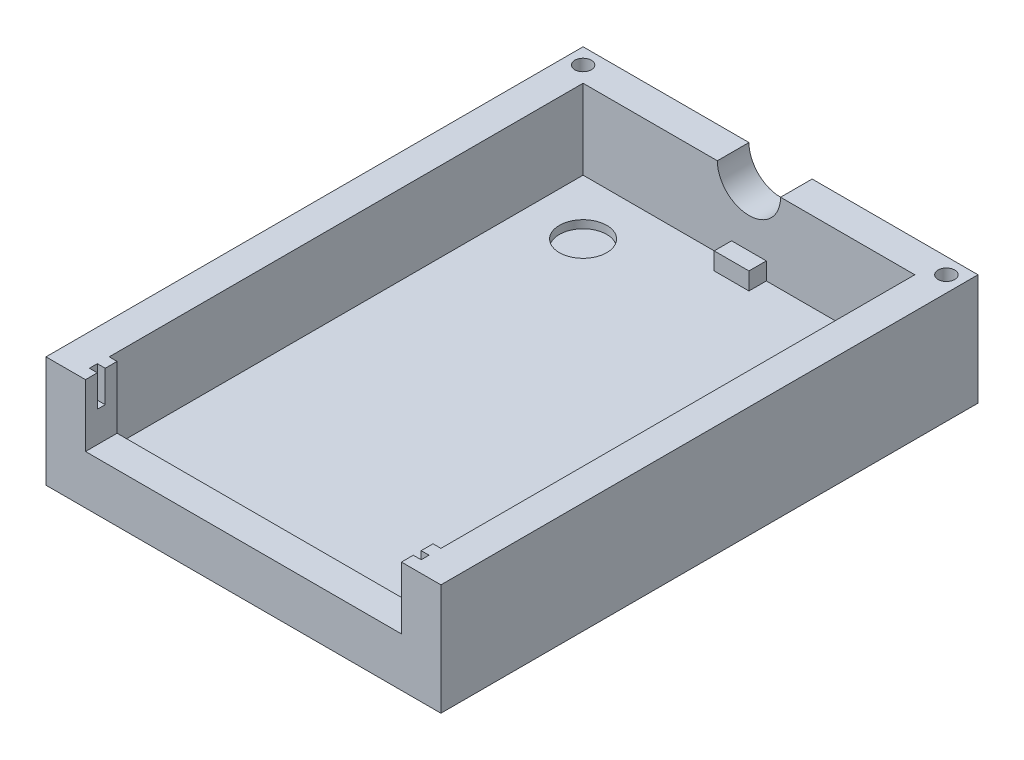
ISO-10303-21;
HEADER;
FILE_DESCRIPTION(('STEP AP214'),'2;1');
FILE_NAME('part.step','',(''),(''),'','','');
FILE_SCHEMA(('AUTOMOTIVE_DESIGN { 1 0 10303 214 1 1 1 1 }'));
ENDSEC;
DATA;
#1=APPLICATION_CONTEXT('core data for automotive mechanical design processes');
#2=APPLICATION_PROTOCOL_DEFINITION('international standard','automotive_design',2000,#1);
#3=PRODUCT_CONTEXT('',#1,'mechanical');
#4=PRODUCT('Part','Part','',(#3));
#5=PRODUCT_RELATED_PRODUCT_CATEGORY('part','',(#4));
#6=PRODUCT_DEFINITION_FORMATION('','',#4);
#7=PRODUCT_DEFINITION_CONTEXT('part definition',#1,'design');
#8=PRODUCT_DEFINITION('design','',#6,#7);
#9=PRODUCT_DEFINITION_SHAPE('','',#8);
#10=(LENGTH_UNIT() NAMED_UNIT(*) SI_UNIT(.MILLI.,.METRE.));
#11=(NAMED_UNIT(*) PLANE_ANGLE_UNIT() SI_UNIT($,.RADIAN.));
#12=(NAMED_UNIT(*) SI_UNIT($,.STERADIAN.) SOLID_ANGLE_UNIT());
#13=UNCERTAINTY_MEASURE_WITH_UNIT(LENGTH_MEASURE(1.E-05),#10,'distance_accuracy_value','');
#14=(GEOMETRIC_REPRESENTATION_CONTEXT(3) GLOBAL_UNCERTAINTY_ASSIGNED_CONTEXT((#13)) GLOBAL_UNIT_ASSIGNED_CONTEXT((#10,
#11,#12)) REPRESENTATION_CONTEXT('',''));
#15=CARTESIAN_POINT('',(0.,0.,0.));
#16=DIRECTION('',(0.,0.,1.));
#17=DIRECTION('',(1.,0.,0.));
#18=AXIS2_PLACEMENT_3D('',#15,#16,#17);
#19=CARTESIAN_POINT('',(0.,7.04,0.));
#20=DIRECTION('',(0.,1.,0.));
#21=DIRECTION('',(0.,0.,1.));
#22=AXIS2_PLACEMENT_3D('',#19,#20,#21);
#23=PLANE('',#22);
#24=CARTESIAN_POINT('',(11.5000000000001,7.04,-15.9999999999998));
#25=DIRECTION('',(0.,1.,0.));
#26=DIRECTION('',(0.,0.,1.));
#27=AXIS2_PLACEMENT_3D('',#24,#25,#26);
#28=CIRCLE('',#27,0.525);
#29=CARTESIAN_POINT('',(11.5000000000001,7.04,-15.4749999999998));
#30=VERTEX_POINT('',#29);
#31=EDGE_CURVE('E442',#30,#30,#28,.T.);
#32=ORIENTED_EDGE('',*,*,#31,.F.);
#33=EDGE_LOOP('',(#32));
#34=FACE_BOUND('',#33,.T.);
#35=DIRECTION('',(0.,0.,-1.));
#36=VECTOR('',#35,1.);
#37=CARTESIAN_POINT('',(2.,7.04,-15.));
#38=LINE('',#37,#36);
#39=CARTESIAN_POINT('',(2.,7.04,-15.));
#40=VERTEX_POINT('',#39);
#41=CARTESIAN_POINT('',(2.,7.04,-17.));
#42=VERTEX_POINT('',#41);
#43=EDGE_CURVE('E217',#40,#42,#38,.T.);
#44=ORIENTED_EDGE('',*,*,#43,.F.);
#45=DIRECTION('',(-1.,0.,0.));
#46=VECTOR('',#45,1.);
#47=CARTESIAN_POINT('',(10.5,7.04,-15.));
#48=LINE('',#47,#46);
#49=CARTESIAN_POINT('',(10.5,7.04,-15.));
#50=VERTEX_POINT('',#49);
#51=EDGE_CURVE('E226',#50,#40,#48,.T.);
#52=ORIENTED_EDGE('',*,*,#51,.F.);
#53=DIRECTION('',(0.,0.,-1.));
#54=VECTOR('',#53,1.);
#55=CARTESIAN_POINT('',(10.5,7.04,15.));
#56=LINE('',#55,#54);
#57=CARTESIAN_POINT('',(10.5,7.04,15.));
#58=VERTEX_POINT('',#57);
#59=EDGE_CURVE('E242',#58,#50,#56,.T.);
#60=ORIENTED_EDGE('',*,*,#59,.F.);
#61=DIRECTION('',(1.,0.,0.));
#62=VECTOR('',#61,1.);
#63=CARTESIAN_POINT('',(-10.5,7.04,15.));
#64=LINE('',#63,#62);
#65=CARTESIAN_POINT('',(9.99999999999999,7.04,15.));
#66=VERTEX_POINT('',#65);
#67=EDGE_CURVE('E346',#66,#58,#64,.T.);
#68=ORIENTED_EDGE('',*,*,#67,.F.);
#69=DIRECTION('',(0.,0.,-1.));
#70=VECTOR('',#69,1.);
#71=CARTESIAN_POINT('',(10.,7.04,17.));
#72=LINE('',#71,#70);
#73=CARTESIAN_POINT('',(10.,7.04,15.75));
#74=VERTEX_POINT('',#73);
#75=EDGE_CURVE('E326',#74,#66,#72,.T.);
#76=ORIENTED_EDGE('',*,*,#75,.F.);
#77=DIRECTION('',(-1.,0.,0.));
#78=VECTOR('',#77,1.);
#79=CARTESIAN_POINT('',(9.5,7.04,15.75));
#80=LINE('',#79,#78);
#81=CARTESIAN_POINT('',(10.5,7.04,15.75));
#82=VERTEX_POINT('',#81);
#83=EDGE_CURVE('E403',#82,#74,#80,.T.);
#84=ORIENTED_EDGE('',*,*,#83,.F.);
#85=DIRECTION('',(0.,0.,-1.));
#86=VECTOR('',#85,1.);
#87=CARTESIAN_POINT('',(10.5,7.04,15.75));
#88=LINE('',#87,#86);
#89=CARTESIAN_POINT('',(10.5,7.04,16.25));
#90=VERTEX_POINT('',#89);
#91=EDGE_CURVE('E399',#90,#82,#88,.T.);
#92=ORIENTED_EDGE('',*,*,#91,.F.);
#93=DIRECTION('',(1.,0.,0.));
#94=VECTOR('',#93,1.);
#95=CARTESIAN_POINT('',(9.5,7.04,16.25));
#96=LINE('',#95,#94);
#97=CARTESIAN_POINT('',(10.,7.04,16.25));
#98=VERTEX_POINT('',#97);
#99=EDGE_CURVE('E393',#98,#90,#96,.T.);
#100=ORIENTED_EDGE('',*,*,#99,.F.);
#101=CARTESIAN_POINT('',(10.,7.04,17.));
#102=VERTEX_POINT('',#101);
#103=EDGE_CURVE('E329',#102,#98,#72,.T.);
#104=ORIENTED_EDGE('',*,*,#103,.F.);
#105=DIRECTION('',(1.,0.,0.));
#106=VECTOR('',#105,1.);
#107=CARTESIAN_POINT('',(-12.5,7.04,17.));
#108=LINE('',#107,#106);
#109=CARTESIAN_POINT('',(12.5,7.04,17.));
#110=VERTEX_POINT('',#109);
#111=EDGE_CURVE('E271',#102,#110,#108,.T.);
#112=ORIENTED_EDGE('',*,*,#111,.T.);
#113=DIRECTION('',(0.,0.,-1.));
#114=VECTOR('',#113,1.);
#115=CARTESIAN_POINT('',(12.5,7.04,17.));
#116=LINE('',#115,#114);
#117=CARTESIAN_POINT('',(12.5,7.04,-17.));
#118=VERTEX_POINT('',#117);
#119=EDGE_CURVE('E275',#110,#118,#116,.T.);
#120=ORIENTED_EDGE('',*,*,#119,.T.);
#121=DIRECTION('',(-1.,0.,0.));
#122=VECTOR('',#121,1.);
#123=CARTESIAN_POINT('',(12.5,7.04,-17.));
#124=LINE('',#123,#122);
#125=EDGE_CURVE('E229',#118,#42,#124,.T.);
#126=ORIENTED_EDGE('',*,*,#125,.T.);
#127=EDGE_LOOP('',(#44,#52,#60,#68,#76,#84,#92,#100,#104,#112,#120,#126));
#128=FACE_BOUND('',#127,.T.);
#129=ADVANCED_FACE('F45',(#34,#128),#23,.T.);
#130=CARTESIAN_POINT('',(-12.5,0.,-17.));
#131=DIRECTION('',(-1.,0.,0.));
#132=DIRECTION('',(0.,0.,1.));
#133=AXIS2_PLACEMENT_3D('',#130,#131,#132);
#134=PLANE('',#133);
#135=DIRECTION('',(0.,0.,1.));
#136=VECTOR('',#135,1.);
#137=CARTESIAN_POINT('',(-12.5,7.04,-17.));
#138=LINE('',#137,#136);
#139=CARTESIAN_POINT('',(-12.5,7.04,-17.));
#140=VERTEX_POINT('',#139);
#141=CARTESIAN_POINT('',(-12.5,7.04,17.));
#142=VERTEX_POINT('',#141);
#143=EDGE_CURVE('E248',#140,#142,#138,.T.);
#144=ORIENTED_EDGE('',*,*,#143,.F.);
#145=DIRECTION('',(0.,1.,0.));
#146=VECTOR('',#145,1.);
#147=CARTESIAN_POINT('',(-12.5,0.,-17.));
#148=LINE('',#147,#146);
#149=CARTESIAN_POINT('',(-12.5,0.,-17.));
#150=VERTEX_POINT('',#149);
#151=EDGE_CURVE('E279',#150,#140,#148,.T.);
#152=ORIENTED_EDGE('',*,*,#151,.F.);
#153=DIRECTION('',(0.,0.,1.));
#154=VECTOR('',#153,1.);
#155=CARTESIAN_POINT('',(-12.5,0.,-17.));
#156=LINE('',#155,#154);
#157=CARTESIAN_POINT('',(-12.5,0.,17.));
#158=VERTEX_POINT('',#157);
#159=EDGE_CURVE('E257',#150,#158,#156,.T.);
#160=ORIENTED_EDGE('',*,*,#159,.T.);
#161=DIRECTION('',(0.,1.,0.));
#162=VECTOR('',#161,1.);
#163=CARTESIAN_POINT('',(-12.5,0.,17.));
#164=LINE('',#163,#162);
#165=EDGE_CURVE('E268',#158,#142,#164,.T.);
#166=ORIENTED_EDGE('',*,*,#165,.T.);
#167=EDGE_LOOP('',(#144,#152,#160,#166));
#168=FACE_BOUND('',#167,.T.);
#169=ADVANCED_FACE('F47',(#168),#134,.T.);
#170=CARTESIAN_POINT('',(12.5,0.,-17.));
#171=DIRECTION('',(0.,0.,-1.));
#172=DIRECTION('',(-1.,0.,0.));
#173=AXIS2_PLACEMENT_3D('',#170,#171,#172);
#174=PLANE('',#173);
#175=CARTESIAN_POINT('',(0.,7.04,-17.));
#176=DIRECTION('',(0.,0.,-1.));
#177=DIRECTION('',(-1.,0.,0.));
#178=AXIS2_PLACEMENT_3D('',#175,#176,#177);
#179=CIRCLE('',#178,2.);
#180=CARTESIAN_POINT('',(-2.,7.04,-17.));
#181=VERTEX_POINT('',#180);
#182=EDGE_CURVE('E424',#42,#181,#179,.T.);
#183=ORIENTED_EDGE('',*,*,#182,.F.);
#184=ORIENTED_EDGE('',*,*,#125,.F.);
#185=DIRECTION('',(0.,1.,0.));
#186=VECTOR('',#185,1.);
#187=CARTESIAN_POINT('',(12.5,0.,-17.));
#188=LINE('',#187,#186);
#189=CARTESIAN_POINT('',(12.5,0.,-17.));
#190=VERTEX_POINT('',#189);
#191=EDGE_CURVE('E283',#190,#118,#188,.T.);
#192=ORIENTED_EDGE('',*,*,#191,.F.);
#193=DIRECTION('',(-1.,0.,0.));
#194=VECTOR('',#193,1.);
#195=CARTESIAN_POINT('',(12.5,0.,-17.));
#196=LINE('',#195,#194);
#197=EDGE_CURVE('E266',#190,#150,#196,.T.);
#198=ORIENTED_EDGE('',*,*,#197,.T.);
#199=ORIENTED_EDGE('',*,*,#151,.T.);
#200=EDGE_CURVE('E277',#181,#140,#124,.T.);
#201=ORIENTED_EDGE('',*,*,#200,.F.);
#202=EDGE_LOOP('',(#183,#184,#192,#198,#199,#201));
#203=FACE_BOUND('',#202,.T.);
#204=ADVANCED_FACE('F481',(#203),#174,.T.);
#205=CARTESIAN_POINT('',(12.5,0.,17.));
#206=DIRECTION('',(1.,0.,0.));
#207=DIRECTION('',(0.,0.,-1.));
#208=AXIS2_PLACEMENT_3D('',#205,#206,#207);
#209=PLANE('',#208);
#210=ORIENTED_EDGE('',*,*,#119,.F.);
#211=DIRECTION('',(0.,1.,0.));
#212=VECTOR('',#211,1.);
#213=CARTESIAN_POINT('',(12.5,0.,17.));
#214=LINE('',#213,#212);
#215=CARTESIAN_POINT('',(12.5,0.,17.));
#216=VERTEX_POINT('',#215);
#217=EDGE_CURVE('E285',#216,#110,#214,.T.);
#218=ORIENTED_EDGE('',*,*,#217,.F.);
#219=DIRECTION('',(0.,0.,-1.));
#220=VECTOR('',#219,1.);
#221=CARTESIAN_POINT('',(12.5,0.,17.));
#222=LINE('',#221,#220);
#223=EDGE_CURVE('E263',#216,#190,#222,.T.);
#224=ORIENTED_EDGE('',*,*,#223,.T.);
#225=ORIENTED_EDGE('',*,*,#191,.T.);
#226=EDGE_LOOP('',(#210,#218,#224,#225));
#227=FACE_BOUND('',#226,.T.);
#228=ADVANCED_FACE('F603',(#227),#209,.T.);
#229=CARTESIAN_POINT('',(-12.5,0.,17.));
#230=DIRECTION('',(0.,0.,1.));
#231=DIRECTION('',(1.,0.,0.));
#232=AXIS2_PLACEMENT_3D('',#229,#230,#231);
#233=PLANE('',#232);
#234=DIRECTION('',(0.,1.,0.));
#235=VECTOR('',#234,1.);
#236=CARTESIAN_POINT('',(-10.,3.1,17.));
#237=LINE('',#236,#235);
#238=CARTESIAN_POINT('',(-10.,3.1,17.));
#239=VERTEX_POINT('',#238);
#240=CARTESIAN_POINT('',(-10.,7.04,17.));
#241=VERTEX_POINT('',#240);
#242=EDGE_CURVE('E360',#239,#241,#237,.T.);
#243=ORIENTED_EDGE('',*,*,#242,.T.);
#244=EDGE_CURVE('E272',#142,#241,#108,.T.);
#245=ORIENTED_EDGE('',*,*,#244,.F.);
#246=ORIENTED_EDGE('',*,*,#165,.F.);
#247=DIRECTION('',(1.,0.,0.));
#248=VECTOR('',#247,1.);
#249=CARTESIAN_POINT('',(-12.5,0.,17.));
#250=LINE('',#249,#248);
#251=EDGE_CURVE('E260',#158,#216,#250,.T.);
#252=ORIENTED_EDGE('',*,*,#251,.T.);
#253=ORIENTED_EDGE('',*,*,#217,.T.);
#254=ORIENTED_EDGE('',*,*,#111,.F.);
#255=DIRECTION('',(0.,-1.,0.));
#256=VECTOR('',#255,1.);
#257=CARTESIAN_POINT('',(10.,7.04,17.));
#258=LINE('',#257,#256);
#259=CARTESIAN_POINT('',(10.,3.1,17.));
#260=VERTEX_POINT('',#259);
#261=EDGE_CURVE('E369',#102,#260,#258,.T.);
#262=ORIENTED_EDGE('',*,*,#261,.T.);
#263=DIRECTION('',(-1.,0.,0.));
#264=VECTOR('',#263,1.);
#265=CARTESIAN_POINT('',(10.,3.1,17.));
#266=LINE('',#265,#264);
#267=EDGE_CURVE('E331',#260,#239,#266,.T.);
#268=ORIENTED_EDGE('',*,*,#267,.T.);
#269=EDGE_LOOP('',(#243,#245,#246,#252,#253,#254,#262,#268));
#270=FACE_BOUND('',#269,.T.);
#271=ADVANCED_FACE('F472',(#270),#233,.T.);
#272=CARTESIAN_POINT('',(0.,0.,0.));
#273=DIRECTION('',(0.,1.,0.));
#274=DIRECTION('',(0.,0.,1.));
#275=AXIS2_PLACEMENT_3D('',#272,#273,#274);
#276=PLANE('',#275);
#277=ORIENTED_EDGE('',*,*,#159,.F.);
#278=ORIENTED_EDGE('',*,*,#197,.F.);
#279=ORIENTED_EDGE('',*,*,#223,.F.);
#280=ORIENTED_EDGE('',*,*,#251,.F.);
#281=EDGE_LOOP('',(#277,#278,#279,#280));
#282=FACE_BOUND('',#281,.T.);
#283=ADVANCED_FACE('F462',(#282),#276,.F.);
#284=CARTESIAN_POINT('',(-11.4999999999999,7.04,-16.));
#285=DIRECTION('',(0.,1.,0.));
#286=DIRECTION('',(0.,0.,1.));
#287=AXIS2_PLACEMENT_3D('',#284,#285,#286);
#288=CIRCLE('',#287,0.525);
#289=CARTESIAN_POINT('',(-11.4999999999999,7.04,-15.475));
#290=VERTEX_POINT('',#289);
#291=EDGE_CURVE('E445',#290,#290,#288,.T.);
#292=ORIENTED_EDGE('',*,*,#291,.F.);
#293=EDGE_LOOP('',(#292));
#294=FACE_BOUND('',#293,.T.);
#295=DIRECTION('',(0.,0.,-1.));
#296=VECTOR('',#295,1.);
#297=CARTESIAN_POINT('',(-2.,7.04,-15.));
#298=LINE('',#297,#296);
#299=CARTESIAN_POINT('',(-2.,7.04,-15.));
#300=VERTEX_POINT('',#299);
#301=EDGE_CURVE('E60',#181,#300,#298,.F.);
#302=ORIENTED_EDGE('',*,*,#301,.F.);
#303=ORIENTED_EDGE('',*,*,#200,.T.);
#304=ORIENTED_EDGE('',*,*,#143,.T.);
#305=ORIENTED_EDGE('',*,*,#244,.T.);
#306=DIRECTION('',(0.,0.,-1.));
#307=VECTOR('',#306,1.);
#308=CARTESIAN_POINT('',(-10.,7.04,17.));
#309=LINE('',#308,#307);
#310=CARTESIAN_POINT('',(-10.,7.04,16.25));
#311=VERTEX_POINT('',#310);
#312=EDGE_CURVE('E317',#241,#311,#309,.T.);
#313=ORIENTED_EDGE('',*,*,#312,.T.);
#314=DIRECTION('',(1.,0.,0.));
#315=VECTOR('',#314,1.);
#316=CARTESIAN_POINT('',(-10.5,7.04,16.25));
#317=LINE('',#316,#315);
#318=CARTESIAN_POINT('',(-10.5,7.04,16.25));
#319=VERTEX_POINT('',#318);
#320=EDGE_CURVE('E324',#319,#311,#317,.T.);
#321=ORIENTED_EDGE('',*,*,#320,.F.);
#322=DIRECTION('',(0.,0.,1.));
#323=VECTOR('',#322,1.);
#324=CARTESIAN_POINT('',(-10.5,7.04,15.75));
#325=LINE('',#324,#323);
#326=CARTESIAN_POINT('',(-10.5,7.04,15.75));
#327=VERTEX_POINT('',#326);
#328=EDGE_CURVE('E415',#327,#319,#325,.T.);
#329=ORIENTED_EDGE('',*,*,#328,.F.);
#330=DIRECTION('',(-1.,0.,0.));
#331=VECTOR('',#330,1.);
#332=CARTESIAN_POINT('',(-10.5,7.04,15.75));
#333=LINE('',#332,#331);
#334=CARTESIAN_POINT('',(-10.,7.04,15.75));
#335=VERTEX_POINT('',#334);
#336=EDGE_CURVE('E402',#335,#327,#333,.T.);
#337=ORIENTED_EDGE('',*,*,#336,.F.);
#338=CARTESIAN_POINT('',(-10.,7.04,15.));
#339=VERTEX_POINT('',#338);
#340=EDGE_CURVE('E327',#335,#339,#309,.T.);
#341=ORIENTED_EDGE('',*,*,#340,.T.);
#342=CARTESIAN_POINT('',(-10.5,7.04,15.));
#343=VERTEX_POINT('',#342);
#344=EDGE_CURVE('E344',#343,#339,#64,.T.);
#345=ORIENTED_EDGE('',*,*,#344,.F.);
#346=DIRECTION('',(0.,0.,1.));
#347=VECTOR('',#346,1.);
#348=CARTESIAN_POINT('',(-10.5,7.04,-15.));
#349=LINE('',#348,#347);
#350=CARTESIAN_POINT('',(-10.5,7.04,-15.));
#351=VERTEX_POINT('',#350);
#352=EDGE_CURVE('E236',#351,#343,#349,.T.);
#353=ORIENTED_EDGE('',*,*,#352,.F.);
#354=EDGE_CURVE('E237',#300,#351,#48,.T.);
#355=ORIENTED_EDGE('',*,*,#354,.F.);
#356=EDGE_LOOP('',(#302,#303,#304,#305,#313,#321,#329,#337,#341,#345,#353,#355));
#357=FACE_BOUND('',#356,.T.);
#358=ADVANCED_FACE('F322',(#294,#357),#23,.T.);
#359=CARTESIAN_POINT('',(-10.5,2.,15.));
#360=DIRECTION('',(0.,0.,1.));
#361=DIRECTION('',(1.,0.,0.));
#362=AXIS2_PLACEMENT_3D('',#359,#360,#361);
#363=PLANE('',#362);
#364=ORIENTED_EDGE('',*,*,#344,.T.);
#365=DIRECTION('',(0.,1.,0.));
#366=VECTOR('',#365,1.);
#367=CARTESIAN_POINT('',(-10.,3.1,15.));
#368=LINE('',#367,#366);
#369=CARTESIAN_POINT('',(-10.,3.1,15.));
#370=VERTEX_POINT('',#369);
#371=EDGE_CURVE('E364',#370,#339,#368,.T.);
#372=ORIENTED_EDGE('',*,*,#371,.F.);
#373=DIRECTION('',(-1.,0.,0.));
#374=VECTOR('',#373,1.);
#375=CARTESIAN_POINT('',(10.,3.1,15.));
#376=LINE('',#375,#374);
#377=CARTESIAN_POINT('',(10.,3.1,15.));
#378=VERTEX_POINT('',#377);
#379=EDGE_CURVE('E358',#378,#370,#376,.T.);
#380=ORIENTED_EDGE('',*,*,#379,.F.);
#381=DIRECTION('',(0.,-1.,0.));
#382=VECTOR('',#381,1.);
#383=CARTESIAN_POINT('',(10.,7.04,15.));
#384=LINE('',#383,#382);
#385=EDGE_CURVE('E361',#66,#378,#384,.T.);
#386=ORIENTED_EDGE('',*,*,#385,.F.);
#387=ORIENTED_EDGE('',*,*,#67,.T.);
#388=DIRECTION('',(0.,1.,0.));
#389=VECTOR('',#388,1.);
#390=CARTESIAN_POINT('',(10.5,2.,15.));
#391=LINE('',#390,#389);
#392=CARTESIAN_POINT('',(10.5,2.,15.));
#393=VERTEX_POINT('',#392);
#394=EDGE_CURVE('E253',#393,#58,#391,.T.);
#395=ORIENTED_EDGE('',*,*,#394,.F.);
#396=DIRECTION('',(1.,0.,0.));
#397=VECTOR('',#396,1.);
#398=CARTESIAN_POINT('',(-10.5,2.,15.));
#399=LINE('',#398,#397);
#400=CARTESIAN_POINT('',(-10.5,2.,15.));
#401=VERTEX_POINT('',#400);
#402=EDGE_CURVE('E240',#401,#393,#399,.T.);
#403=ORIENTED_EDGE('',*,*,#402,.F.);
#404=DIRECTION('',(0.,1.,0.));
#405=VECTOR('',#404,1.);
#406=CARTESIAN_POINT('',(-10.5,2.,15.));
#407=LINE('',#406,#405);
#408=EDGE_CURVE('E246',#401,#343,#407,.T.);
#409=ORIENTED_EDGE('',*,*,#408,.T.);
#410=EDGE_LOOP('',(#364,#372,#380,#386,#387,#395,#403,#409));
#411=FACE_BOUND('',#410,.T.);
#412=ADVANCED_FACE('F461',(#411),#363,.F.);
#413=CARTESIAN_POINT('',(-10.5,2.,-15.));
#414=DIRECTION('',(-1.,0.,0.));
#415=DIRECTION('',(0.,0.,1.));
#416=AXIS2_PLACEMENT_3D('',#413,#414,#415);
#417=PLANE('',#416);
#418=ORIENTED_EDGE('',*,*,#352,.T.);
#419=ORIENTED_EDGE('',*,*,#408,.F.);
#420=DIRECTION('',(0.,0.,1.));
#421=VECTOR('',#420,1.);
#422=CARTESIAN_POINT('',(-10.5,2.,-15.));
#423=LINE('',#422,#421);
#424=CARTESIAN_POINT('',(-10.5,2.,-15.));
#425=VERTEX_POINT('',#424);
#426=EDGE_CURVE('E256',#425,#401,#423,.T.);
#427=ORIENTED_EDGE('',*,*,#426,.F.);
#428=DIRECTION('',(0.,1.,0.));
#429=VECTOR('',#428,1.);
#430=CARTESIAN_POINT('',(-10.5,2.,-15.));
#431=LINE('',#430,#429);
#432=EDGE_CURVE('E249',#425,#351,#431,.T.);
#433=ORIENTED_EDGE('',*,*,#432,.T.);
#434=EDGE_LOOP('',(#418,#419,#427,#433));
#435=FACE_BOUND('',#434,.T.);
#436=ADVANCED_FACE('F469',(#435),#417,.F.);
#437=CARTESIAN_POINT('',(10.5,2.,-15.));
#438=DIRECTION('',(0.,0.,-1.));
#439=DIRECTION('',(-1.,0.,0.));
#440=AXIS2_PLACEMENT_3D('',#437,#438,#439);
#441=PLANE('',#440);
#442=ORIENTED_EDGE('',*,*,#51,.T.);
#443=CARTESIAN_POINT('',(0.,7.04,-15.));
#444=DIRECTION('',(0.,0.,-1.));
#445=DIRECTION('',(-1.,0.,0.));
#446=AXIS2_PLACEMENT_3D('',#443,#444,#445);
#447=CIRCLE('',#446,2.);
#448=EDGE_CURVE('E11',#40,#300,#447,.T.);
#449=ORIENTED_EDGE('',*,*,#448,.T.);
#450=ORIENTED_EDGE('',*,*,#354,.T.);
#451=ORIENTED_EDGE('',*,*,#432,.F.);
#452=DIRECTION('',(-1.,0.,0.));
#453=VECTOR('',#452,1.);
#454=CARTESIAN_POINT('',(10.5,2.,-15.));
#455=LINE('',#454,#453);
#456=CARTESIAN_POINT('',(-1.1,2.,-15.));
#457=VERTEX_POINT('',#456);
#458=EDGE_CURVE('E339',#457,#425,#455,.T.);
#459=ORIENTED_EDGE('',*,*,#458,.F.);
#460=DIRECTION('',(0.,-1.,0.));
#461=VECTOR('',#460,1.);
#462=CARTESIAN_POINT('',(-1.1,2.,-15.));
#463=LINE('',#462,#461);
#464=CARTESIAN_POINT('',(-1.1,3.1,-15.));
#465=VERTEX_POINT('',#464);
#466=EDGE_CURVE('E374',#465,#457,#463,.T.);
#467=ORIENTED_EDGE('',*,*,#466,.F.);
#468=DIRECTION('',(1.,0.,0.));
#469=VECTOR('',#468,1.);
#470=CARTESIAN_POINT('',(10.5,3.1,-15.));
#471=LINE('',#470,#469);
#472=CARTESIAN_POINT('',(1.1,3.1,-15.));
#473=VERTEX_POINT('',#472);
#474=EDGE_CURVE('E296',#465,#473,#471,.T.);
#475=ORIENTED_EDGE('',*,*,#474,.T.);
#476=DIRECTION('',(0.,-1.,0.));
#477=VECTOR('',#476,1.);
#478=CARTESIAN_POINT('',(1.1,2.,-15.));
#479=LINE('',#478,#477);
#480=CARTESIAN_POINT('',(1.1,2.,-15.));
#481=VERTEX_POINT('',#480);
#482=EDGE_CURVE('E366',#473,#481,#479,.T.);
#483=ORIENTED_EDGE('',*,*,#482,.T.);
#484=CARTESIAN_POINT('',(10.5,2.,-15.));
#485=VERTEX_POINT('',#484);
#486=EDGE_CURVE('E340',#485,#481,#455,.T.);
#487=ORIENTED_EDGE('',*,*,#486,.F.);
#488=DIRECTION('',(0.,1.,0.));
#489=VECTOR('',#488,1.);
#490=CARTESIAN_POINT('',(10.5,2.,-15.));
#491=LINE('',#490,#489);
#492=EDGE_CURVE('E234',#485,#50,#491,.T.);
#493=ORIENTED_EDGE('',*,*,#492,.T.);
#494=EDGE_LOOP('',(#442,#449,#450,#451,#459,#467,#475,#483,#487,#493));
#495=FACE_BOUND('',#494,.T.);
#496=ADVANCED_FACE('F232',(#495),#441,.F.);
#497=CARTESIAN_POINT('',(10.5,2.,15.));
#498=DIRECTION('',(1.,0.,0.));
#499=DIRECTION('',(0.,0.,-1.));
#500=AXIS2_PLACEMENT_3D('',#497,#498,#499);
#501=PLANE('',#500);
#502=ORIENTED_EDGE('',*,*,#59,.T.);
#503=ORIENTED_EDGE('',*,*,#492,.F.);
#504=DIRECTION('',(0.,0.,-1.));
#505=VECTOR('',#504,1.);
#506=CARTESIAN_POINT('',(10.5,2.,15.));
#507=LINE('',#506,#505);
#508=EDGE_CURVE('E336',#393,#485,#507,.T.);
#509=ORIENTED_EDGE('',*,*,#508,.F.);
#510=ORIENTED_EDGE('',*,*,#394,.T.);
#511=EDGE_LOOP('',(#502,#503,#509,#510));
#512=FACE_BOUND('',#511,.T.);
#513=ADVANCED_FACE('F575',(#512),#501,.F.);
#514=CARTESIAN_POINT('',(0.,2.,0.));
#515=DIRECTION('',(0.,1.,0.));
#516=DIRECTION('',(0.,0.,1.));
#517=AXIS2_PLACEMENT_3D('',#514,#515,#516);
#518=PLANE('',#517);
#519=CARTESIAN_POINT('',(-7.,2.,-11.5));
#520=DIRECTION('',(0.,1.,0.));
#521=DIRECTION('',(0.,0.,1.));
#522=AXIS2_PLACEMENT_3D('',#519,#520,#521);
#523=CIRCLE('',#522,1.5);
#524=CARTESIAN_POINT('',(-7.,2.,-10.));
#525=VERTEX_POINT('',#524);
#526=EDGE_CURVE('E434',#525,#525,#523,.T.);
#527=ORIENTED_EDGE('',*,*,#526,.F.);
#528=EDGE_LOOP('',(#527));
#529=FACE_BOUND('',#528,.T.);
#530=CARTESIAN_POINT('',(7.,2.,-11.5));
#531=DIRECTION('',(0.,1.,0.));
#532=DIRECTION('',(0.,0.,1.));
#533=AXIS2_PLACEMENT_3D('',#530,#531,#532);
#534=CIRCLE('',#533,1.5);
#535=CARTESIAN_POINT('',(7.,2.,-10.));
#536=VERTEX_POINT('',#535);
#537=EDGE_CURVE('E430',#536,#536,#534,.T.);
#538=ORIENTED_EDGE('',*,*,#537,.F.);
#539=EDGE_LOOP('',(#538));
#540=FACE_BOUND('',#539,.T.);
#541=DIRECTION('',(0.,0.,-1.));
#542=VECTOR('',#541,1.);
#543=CARTESIAN_POINT('',(1.1,2.,0.));
#544=LINE('',#543,#542);
#545=CARTESIAN_POINT('',(1.1,2.,-13.9));
#546=VERTEX_POINT('',#545);
#547=EDGE_CURVE('E293',#546,#481,#544,.T.);
#548=ORIENTED_EDGE('',*,*,#547,.F.);
#549=DIRECTION('',(1.,0.,0.));
#550=VECTOR('',#549,1.);
#551=CARTESIAN_POINT('',(0.,2.,-13.9));
#552=LINE('',#551,#550);
#553=CARTESIAN_POINT('',(-1.1,2.,-13.9));
#554=VERTEX_POINT('',#553);
#555=EDGE_CURVE('E291',#554,#546,#552,.T.);
#556=ORIENTED_EDGE('',*,*,#555,.F.);
#557=DIRECTION('',(0.,0.,-1.));
#558=VECTOR('',#557,1.);
#559=CARTESIAN_POINT('',(-1.1,2.,0.));
#560=LINE('',#559,#558);
#561=EDGE_CURVE('E282',#554,#457,#560,.T.);
#562=ORIENTED_EDGE('',*,*,#561,.T.);
#563=ORIENTED_EDGE('',*,*,#458,.T.);
#564=ORIENTED_EDGE('',*,*,#426,.T.);
#565=ORIENTED_EDGE('',*,*,#402,.T.);
#566=ORIENTED_EDGE('',*,*,#508,.T.);
#567=ORIENTED_EDGE('',*,*,#486,.T.);
#568=EDGE_LOOP('',(#548,#556,#562,#563,#564,#565,#566,#567));
#569=FACE_BOUND('',#568,.T.);
#570=ADVANCED_FACE('F572',(#529,#540,#569),#518,.T.);
#571=CARTESIAN_POINT('',(-10.,3.1,17.));
#572=DIRECTION('',(-1.,0.,0.));
#573=DIRECTION('',(0.,0.,1.));
#574=AXIS2_PLACEMENT_3D('',#571,#572,#573);
#575=PLANE('',#574);
#576=DIRECTION('',(0.,0.,-1.));
#577=VECTOR('',#576,1.);
#578=CARTESIAN_POINT('',(-10.,5.04,17.));
#579=LINE('',#578,#577);
#580=CARTESIAN_POINT('',(-10.,5.04,16.25));
#581=VERTEX_POINT('',#580);
#582=CARTESIAN_POINT('',(-10.,5.04,15.75));
#583=VERTEX_POINT('',#582);
#584=EDGE_CURVE('E307',#581,#583,#579,.T.);
#585=ORIENTED_EDGE('',*,*,#584,.F.);
#586=DIRECTION('',(0.,1.,0.));
#587=VECTOR('',#586,1.);
#588=CARTESIAN_POINT('',(-10.,3.1,16.25));
#589=LINE('',#588,#587);
#590=EDGE_CURVE('E53',#581,#311,#589,.T.);
#591=ORIENTED_EDGE('',*,*,#590,.T.);
#592=ORIENTED_EDGE('',*,*,#312,.F.);
#593=ORIENTED_EDGE('',*,*,#242,.F.);
#594=DIRECTION('',(0.,0.,-1.));
#595=VECTOR('',#594,1.);
#596=CARTESIAN_POINT('',(-10.,3.1,17.));
#597=LINE('',#596,#595);
#598=EDGE_CURVE('E350',#239,#370,#597,.T.);
#599=ORIENTED_EDGE('',*,*,#598,.T.);
#600=ORIENTED_EDGE('',*,*,#371,.T.);
#601=ORIENTED_EDGE('',*,*,#340,.F.);
#602=DIRECTION('',(0.,-1.,0.));
#603=VECTOR('',#602,1.);
#604=CARTESIAN_POINT('',(-10.,3.1,15.75));
#605=LINE('',#604,#603);
#606=EDGE_CURVE('E309',#335,#583,#605,.T.);
#607=ORIENTED_EDGE('',*,*,#606,.T.);
#608=EDGE_LOOP('',(#585,#591,#592,#593,#599,#600,#601,#607));
#609=FACE_BOUND('',#608,.T.);
#610=ADVANCED_FACE('F315',(#609),#575,.F.);
#611=CARTESIAN_POINT('',(10.,3.1,17.));
#612=DIRECTION('',(0.,-1.,0.));
#613=DIRECTION('',(1.,0.,0.));
#614=AXIS2_PLACEMENT_3D('',#611,#612,#613);
#615=PLANE('',#614);
#616=ORIENTED_EDGE('',*,*,#379,.T.);
#617=ORIENTED_EDGE('',*,*,#598,.F.);
#618=ORIENTED_EDGE('',*,*,#267,.F.);
#619=DIRECTION('',(0.,0.,-1.));
#620=VECTOR('',#619,1.);
#621=CARTESIAN_POINT('',(10.,3.1,17.));
#622=LINE('',#621,#620);
#623=EDGE_CURVE('E353',#260,#378,#622,.T.);
#624=ORIENTED_EDGE('',*,*,#623,.T.);
#625=EDGE_LOOP('',(#616,#617,#618,#624));
#626=FACE_BOUND('',#625,.T.);
#627=ADVANCED_FACE('F563',(#626),#615,.F.);
#628=CARTESIAN_POINT('',(10.,7.04,17.));
#629=DIRECTION('',(1.,0.,0.));
#630=DIRECTION('',(0.,0.,-1.));
#631=AXIS2_PLACEMENT_3D('',#628,#629,#630);
#632=PLANE('',#631);
#633=ORIENTED_EDGE('',*,*,#103,.T.);
#634=DIRECTION('',(0.,-1.,0.));
#635=VECTOR('',#634,1.);
#636=CARTESIAN_POINT('',(10.,7.04,16.25));
#637=LINE('',#636,#635);
#638=CARTESIAN_POINT('',(10.,5.04,16.25));
#639=VERTEX_POINT('',#638);
#640=EDGE_CURVE('E304',#98,#639,#637,.T.);
#641=ORIENTED_EDGE('',*,*,#640,.T.);
#642=DIRECTION('',(0.,0.,1.));
#643=VECTOR('',#642,1.);
#644=CARTESIAN_POINT('',(10.,5.04,17.));
#645=LINE('',#644,#643);
#646=CARTESIAN_POINT('',(10.,5.04,15.75));
#647=VERTEX_POINT('',#646);
#648=EDGE_CURVE('E299',#647,#639,#645,.T.);
#649=ORIENTED_EDGE('',*,*,#648,.F.);
#650=DIRECTION('',(0.,1.,0.));
#651=VECTOR('',#650,1.);
#652=CARTESIAN_POINT('',(10.,7.04,15.75));
#653=LINE('',#652,#651);
#654=EDGE_CURVE('E301',#647,#74,#653,.T.);
#655=ORIENTED_EDGE('',*,*,#654,.T.);
#656=ORIENTED_EDGE('',*,*,#75,.T.);
#657=ORIENTED_EDGE('',*,*,#385,.T.);
#658=ORIENTED_EDGE('',*,*,#623,.F.);
#659=ORIENTED_EDGE('',*,*,#261,.F.);
#660=EDGE_LOOP('',(#633,#641,#649,#655,#656,#657,#658,#659));
#661=FACE_BOUND('',#660,.T.);
#662=ADVANCED_FACE('F561',(#661),#632,.F.);
#663=CARTESIAN_POINT('',(0.,3.1,-15.));
#664=DIRECTION('',(0.,1.,0.));
#665=DIRECTION('',(0.,0.,1.));
#666=AXIS2_PLACEMENT_3D('',#663,#664,#665);
#667=PLANE('',#666);
#668=ORIENTED_EDGE('',*,*,#474,.F.);
#669=DIRECTION('',(0.,0.,-1.));
#670=VECTOR('',#669,1.);
#671=CARTESIAN_POINT('',(-1.1,3.1,0.));
#672=LINE('',#671,#670);
#673=CARTESIAN_POINT('',(-1.1,3.1,-13.9));
#674=VERTEX_POINT('',#673);
#675=EDGE_CURVE('E380',#465,#674,#672,.F.);
#676=ORIENTED_EDGE('',*,*,#675,.T.);
#677=DIRECTION('',(1.,0.,0.));
#678=VECTOR('',#677,1.);
#679=CARTESIAN_POINT('',(0.,3.1,-13.9));
#680=LINE('',#679,#678);
#681=CARTESIAN_POINT('',(1.1,3.1,-13.9));
#682=VERTEX_POINT('',#681);
#683=EDGE_CURVE('E376',#674,#682,#680,.T.);
#684=ORIENTED_EDGE('',*,*,#683,.T.);
#685=DIRECTION('',(0.,0.,-1.));
#686=VECTOR('',#685,1.);
#687=CARTESIAN_POINT('',(1.1,3.1,0.));
#688=LINE('',#687,#686);
#689=EDGE_CURVE('E379',#473,#682,#688,.F.);
#690=ORIENTED_EDGE('',*,*,#689,.F.);
#691=EDGE_LOOP('',(#668,#676,#684,#690));
#692=FACE_BOUND('',#691,.T.);
#693=ADVANCED_FACE('F551',(#692),#667,.T.);
#694=CARTESIAN_POINT('',(1.1,3.52,0.));
#695=DIRECTION('',(1.,0.,0.));
#696=DIRECTION('',(0.,0.,-1.));
#697=AXIS2_PLACEMENT_3D('',#694,#695,#696);
#698=PLANE('',#697);
#699=ORIENTED_EDGE('',*,*,#547,.T.);
#700=ORIENTED_EDGE('',*,*,#482,.F.);
#701=ORIENTED_EDGE('',*,*,#689,.T.);
#702=DIRECTION('',(0.,1.,0.));
#703=VECTOR('',#702,1.);
#704=CARTESIAN_POINT('',(1.1,3.52,-13.9));
#705=LINE('',#704,#703);
#706=EDGE_CURVE('E382',#682,#546,#705,.F.);
#707=ORIENTED_EDGE('',*,*,#706,.T.);
#708=EDGE_LOOP('',(#699,#700,#701,#707));
#709=FACE_BOUND('',#708,.T.);
#710=ADVANCED_FACE('F547',(#709),#698,.T.);
#711=CARTESIAN_POINT('',(-1.1,3.52,0.));
#712=DIRECTION('',(1.,0.,0.));
#713=DIRECTION('',(0.,0.,-1.));
#714=AXIS2_PLACEMENT_3D('',#711,#712,#713);
#715=PLANE('',#714);
#716=ORIENTED_EDGE('',*,*,#675,.F.);
#717=ORIENTED_EDGE('',*,*,#466,.T.);
#718=ORIENTED_EDGE('',*,*,#561,.F.);
#719=DIRECTION('',(0.,1.,0.));
#720=VECTOR('',#719,1.);
#721=CARTESIAN_POINT('',(-1.1,3.52,-13.9));
#722=LINE('',#721,#720);
#723=EDGE_CURVE('E383',#674,#554,#722,.F.);
#724=ORIENTED_EDGE('',*,*,#723,.F.);
#725=EDGE_LOOP('',(#716,#717,#718,#724));
#726=FACE_BOUND('',#725,.T.);
#727=ADVANCED_FACE('F550',(#726),#715,.F.);
#728=CARTESIAN_POINT('',(0.,3.1,-13.9));
#729=DIRECTION('',(0.,0.,1.));
#730=DIRECTION('',(0.,-1.,0.));
#731=AXIS2_PLACEMENT_3D('',#728,#729,#730);
#732=PLANE('',#731);
#733=ORIENTED_EDGE('',*,*,#723,.T.);
#734=ORIENTED_EDGE('',*,*,#555,.T.);
#735=ORIENTED_EDGE('',*,*,#706,.F.);
#736=ORIENTED_EDGE('',*,*,#683,.F.);
#737=EDGE_LOOP('',(#733,#734,#735,#736));
#738=FACE_BOUND('',#737,.T.);
#739=ADVANCED_FACE('F542',(#738),#732,.T.);
#740=CARTESIAN_POINT('',(9.5,5.04,16.25));
#741=DIRECTION('',(0.,0.,1.));
#742=DIRECTION('',(1.,0.,0.));
#743=AXIS2_PLACEMENT_3D('',#740,#741,#742);
#744=PLANE('',#743);
#745=ORIENTED_EDGE('',*,*,#99,.T.);
#746=DIRECTION('',(0.,1.,0.));
#747=VECTOR('',#746,1.);
#748=CARTESIAN_POINT('',(10.5,5.04,16.25));
#749=LINE('',#748,#747);
#750=CARTESIAN_POINT('',(10.5,5.04,16.25));
#751=VERTEX_POINT('',#750);
#752=EDGE_CURVE('E230',#751,#90,#749,.T.);
#753=ORIENTED_EDGE('',*,*,#752,.F.);
#754=DIRECTION('',(1.,0.,0.));
#755=VECTOR('',#754,1.);
#756=CARTESIAN_POINT('',(9.5,5.04,16.25));
#757=LINE('',#756,#755);
#758=EDGE_CURVE('E396',#639,#751,#757,.T.);
#759=ORIENTED_EDGE('',*,*,#758,.F.);
#760=ORIENTED_EDGE('',*,*,#640,.F.);
#761=EDGE_LOOP('',(#745,#753,#759,#760));
#762=FACE_BOUND('',#761,.T.);
#763=ADVANCED_FACE('F538',(#762),#744,.F.);
#764=CARTESIAN_POINT('',(9.5,5.04,15.75));
#765=DIRECTION('',(0.,0.,-1.));
#766=DIRECTION('',(-1.,0.,0.));
#767=AXIS2_PLACEMENT_3D('',#764,#765,#766);
#768=PLANE('',#767);
#769=DIRECTION('',(-1.,0.,0.));
#770=VECTOR('',#769,1.);
#771=CARTESIAN_POINT('',(9.5,5.04,15.75));
#772=LINE('',#771,#770);
#773=CARTESIAN_POINT('',(10.5,5.04,15.75));
#774=VERTEX_POINT('',#773);
#775=EDGE_CURVE('E394',#774,#647,#772,.T.);
#776=ORIENTED_EDGE('',*,*,#775,.F.);
#777=DIRECTION('',(0.,1.,0.));
#778=VECTOR('',#777,1.);
#779=CARTESIAN_POINT('',(10.5,5.04,15.75));
#780=LINE('',#779,#778);
#781=EDGE_CURVE('E398',#774,#82,#780,.T.);
#782=ORIENTED_EDGE('',*,*,#781,.T.);
#783=ORIENTED_EDGE('',*,*,#83,.T.);
#784=ORIENTED_EDGE('',*,*,#654,.F.);
#785=EDGE_LOOP('',(#776,#782,#783,#784));
#786=FACE_BOUND('',#785,.T.);
#787=ADVANCED_FACE('F535',(#786),#768,.F.);
#788=CARTESIAN_POINT('',(0.,5.04,0.));
#789=DIRECTION('',(0.,1.,0.));
#790=DIRECTION('',(0.,0.,1.));
#791=AXIS2_PLACEMENT_3D('',#788,#789,#790);
#792=PLANE('',#791);
#793=ORIENTED_EDGE('',*,*,#648,.T.);
#794=ORIENTED_EDGE('',*,*,#758,.T.);
#795=DIRECTION('',(0.,0.,-1.));
#796=VECTOR('',#795,1.);
#797=CARTESIAN_POINT('',(10.5,5.04,15.75));
#798=LINE('',#797,#796);
#799=EDGE_CURVE('E390',#751,#774,#798,.T.);
#800=ORIENTED_EDGE('',*,*,#799,.T.);
#801=ORIENTED_EDGE('',*,*,#775,.T.);
#802=EDGE_LOOP('',(#793,#794,#800,#801));
#803=FACE_BOUND('',#802,.T.);
#804=ADVANCED_FACE('F533',(#803),#792,.T.);
#805=CARTESIAN_POINT('',(10.5,5.04,15.75));
#806=DIRECTION('',(1.,0.,0.));
#807=DIRECTION('',(0.,0.,-1.));
#808=AXIS2_PLACEMENT_3D('',#805,#806,#807);
#809=PLANE('',#808);
#810=ORIENTED_EDGE('',*,*,#91,.T.);
#811=ORIENTED_EDGE('',*,*,#781,.F.);
#812=ORIENTED_EDGE('',*,*,#799,.F.);
#813=ORIENTED_EDGE('',*,*,#752,.T.);
#814=EDGE_LOOP('',(#810,#811,#812,#813));
#815=FACE_BOUND('',#814,.T.);
#816=ADVANCED_FACE('F524',(#815),#809,.F.);
#817=CARTESIAN_POINT('',(-10.5,5.04,16.25));
#818=DIRECTION('',(0.,0.,1.));
#819=DIRECTION('',(1.,0.,0.));
#820=AXIS2_PLACEMENT_3D('',#817,#818,#819);
#821=PLANE('',#820);
#822=DIRECTION('',(1.,0.,0.));
#823=VECTOR('',#822,1.);
#824=CARTESIAN_POINT('',(-10.5,5.04,16.25));
#825=LINE('',#824,#823);
#826=CARTESIAN_POINT('',(-10.5,5.04,16.25));
#827=VERTEX_POINT('',#826);
#828=EDGE_CURVE('E67',#827,#581,#825,.T.);
#829=ORIENTED_EDGE('',*,*,#828,.F.);
#830=DIRECTION('',(0.,1.,0.));
#831=VECTOR('',#830,1.);
#832=CARTESIAN_POINT('',(-10.5,5.04,16.25));
#833=LINE('',#832,#831);
#834=EDGE_CURVE('E386',#827,#319,#833,.T.);
#835=ORIENTED_EDGE('',*,*,#834,.T.);
#836=ORIENTED_EDGE('',*,*,#320,.T.);
#837=ORIENTED_EDGE('',*,*,#590,.F.);
#838=EDGE_LOOP('',(#829,#835,#836,#837));
#839=FACE_BOUND('',#838,.T.);
#840=ADVANCED_FACE('F521',(#839),#821,.F.);
#841=CARTESIAN_POINT('',(-10.5,5.04,15.75));
#842=DIRECTION('',(0.,0.,-1.));
#843=DIRECTION('',(-1.,0.,0.));
#844=AXIS2_PLACEMENT_3D('',#841,#842,#843);
#845=PLANE('',#844);
#846=ORIENTED_EDGE('',*,*,#336,.T.);
#847=DIRECTION('',(0.,1.,0.));
#848=VECTOR('',#847,1.);
#849=CARTESIAN_POINT('',(-10.5,5.04,15.75));
#850=LINE('',#849,#848);
#851=CARTESIAN_POINT('',(-10.5,5.04,15.75));
#852=VERTEX_POINT('',#851);
#853=EDGE_CURVE('E409',#852,#327,#850,.T.);
#854=ORIENTED_EDGE('',*,*,#853,.F.);
#855=DIRECTION('',(-1.,0.,0.));
#856=VECTOR('',#855,1.);
#857=CARTESIAN_POINT('',(-10.5,5.04,15.75));
#858=LINE('',#857,#856);
#859=EDGE_CURVE('E414',#583,#852,#858,.T.);
#860=ORIENTED_EDGE('',*,*,#859,.F.);
#861=ORIENTED_EDGE('',*,*,#606,.F.);
#862=EDGE_LOOP('',(#846,#854,#860,#861));
#863=FACE_BOUND('',#862,.T.);
#864=ADVANCED_FACE('F520',(#863),#845,.F.);
#865=CARTESIAN_POINT('',(0.,5.04,0.));
#866=DIRECTION('',(0.,1.,0.));
#867=DIRECTION('',(0.,0.,1.));
#868=AXIS2_PLACEMENT_3D('',#865,#866,#867);
#869=PLANE('',#868);
#870=ORIENTED_EDGE('',*,*,#584,.T.);
#871=ORIENTED_EDGE('',*,*,#859,.T.);
#872=DIRECTION('',(0.,0.,1.));
#873=VECTOR('',#872,1.);
#874=CARTESIAN_POINT('',(-10.5,5.04,15.75));
#875=LINE('',#874,#873);
#876=EDGE_CURVE('E420',#852,#827,#875,.T.);
#877=ORIENTED_EDGE('',*,*,#876,.T.);
#878=ORIENTED_EDGE('',*,*,#828,.T.);
#879=EDGE_LOOP('',(#870,#871,#877,#878));
#880=FACE_BOUND('',#879,.T.);
#881=ADVANCED_FACE('F517',(#880),#869,.T.);
#882=CARTESIAN_POINT('',(-10.5,5.04,15.75));
#883=DIRECTION('',(-1.,0.,0.));
#884=DIRECTION('',(0.,0.,1.));
#885=AXIS2_PLACEMENT_3D('',#882,#883,#884);
#886=PLANE('',#885);
#887=ORIENTED_EDGE('',*,*,#328,.T.);
#888=ORIENTED_EDGE('',*,*,#834,.F.);
#889=ORIENTED_EDGE('',*,*,#876,.F.);
#890=ORIENTED_EDGE('',*,*,#853,.T.);
#891=EDGE_LOOP('',(#887,#888,#889,#890));
#892=FACE_BOUND('',#891,.T.);
#893=ADVANCED_FACE('F516',(#892),#886,.F.);
#894=CARTESIAN_POINT('',(0.,7.04,-15.));
#895=DIRECTION('',(0.,0.,-1.));
#896=DIRECTION('',(-1.,0.,0.));
#897=AXIS2_PLACEMENT_3D('',#894,#895,#896);
#898=CYLINDRICAL_SURFACE('',#897,2.);
#899=ORIENTED_EDGE('',*,*,#43,.T.);
#900=ORIENTED_EDGE('',*,*,#182,.T.);
#901=ORIENTED_EDGE('',*,*,#301,.T.);
#902=ORIENTED_EDGE('',*,*,#448,.F.);
#903=EDGE_LOOP('',(#899,#900,#901,#902));
#904=FACE_BOUND('',#903,.T.);
#905=ADVANCED_FACE('F216',(#904),#898,.F.);
#906=CARTESIAN_POINT('',(7.,1.5,-11.5));
#907=DIRECTION('',(0.,1.,0.));
#908=DIRECTION('',(0.,0.,1.));
#909=AXIS2_PLACEMENT_3D('',#906,#907,#908);
#910=CYLINDRICAL_SURFACE('',#909,1.5);
#911=CARTESIAN_POINT('',(7.,1.5,-11.5));
#912=DIRECTION('',(0.,1.,0.));
#913=DIRECTION('',(0.,0.,1.));
#914=AXIS2_PLACEMENT_3D('',#911,#912,#913);
#915=CIRCLE('',#914,1.5);
#916=CARTESIAN_POINT('',(7.,1.5,-10.));
#917=VERTEX_POINT('',#916);
#918=EDGE_CURVE('E427',#917,#917,#915,.T.);
#919=ORIENTED_EDGE('',*,*,#918,.F.);
#920=EDGE_LOOP('',(#919));
#921=FACE_BOUND('',#920,.T.);
#922=ORIENTED_EDGE('',*,*,#537,.T.);
#923=EDGE_LOOP('',(#922));
#924=FACE_BOUND('',#923,.T.);
#925=ADVANCED_FACE('F507',(#921,#924),#910,.F.);
#926=CARTESIAN_POINT('',(7.,1.5,-11.5));
#927=DIRECTION('',(0.,1.,0.));
#928=DIRECTION('',(0.,0.,1.));
#929=AXIS2_PLACEMENT_3D('',#926,#927,#928);
#930=PLANE('',#929);
#931=ORIENTED_EDGE('',*,*,#918,.T.);
#932=EDGE_LOOP('',(#931));
#933=FACE_BOUND('',#932,.T.);
#934=ADVANCED_FACE('F505',(#933),#930,.T.);
#935=CARTESIAN_POINT('',(-7.,1.5,-11.5));
#936=DIRECTION('',(0.,1.,0.));
#937=DIRECTION('',(0.,0.,1.));
#938=AXIS2_PLACEMENT_3D('',#935,#936,#937);
#939=CYLINDRICAL_SURFACE('',#938,1.5);
#940=CARTESIAN_POINT('',(-7.,1.5,-11.5));
#941=DIRECTION('',(0.,1.,0.));
#942=DIRECTION('',(0.,0.,1.));
#943=AXIS2_PLACEMENT_3D('',#940,#941,#942);
#944=CIRCLE('',#943,1.5);
#945=CARTESIAN_POINT('',(-7.,1.5,-10.));
#946=VERTEX_POINT('',#945);
#947=EDGE_CURVE('E426',#946,#946,#944,.T.);
#948=ORIENTED_EDGE('',*,*,#947,.F.);
#949=EDGE_LOOP('',(#948));
#950=FACE_BOUND('',#949,.T.);
#951=ORIENTED_EDGE('',*,*,#526,.T.);
#952=EDGE_LOOP('',(#951));
#953=FACE_BOUND('',#952,.T.);
#954=ADVANCED_FACE('F501',(#950,#953),#939,.F.);
#955=CARTESIAN_POINT('',(-7.,1.5,-11.5));
#956=DIRECTION('',(0.,1.,0.));
#957=DIRECTION('',(0.,0.,1.));
#958=AXIS2_PLACEMENT_3D('',#955,#956,#957);
#959=PLANE('',#958);
#960=ORIENTED_EDGE('',*,*,#947,.T.);
#961=EDGE_LOOP('',(#960));
#962=FACE_BOUND('',#961,.T.);
#963=ADVANCED_FACE('F456',(#962),#959,.T.);
#964=CARTESIAN_POINT('',(-11.4999999999999,6.03,-16.));
#965=DIRECTION('',(0.,1.,0.));
#966=DIRECTION('',(0.,0.,1.));
#967=AXIS2_PLACEMENT_3D('',#964,#965,#966);
#968=CYLINDRICAL_SURFACE('',#967,0.525);
#969=CARTESIAN_POINT('',(-11.4999999999999,6.03,-16.));
#970=DIRECTION('',(0.,1.,0.));
#971=DIRECTION('',(0.,0.,1.));
#972=AXIS2_PLACEMENT_3D('',#969,#970,#971);
#973=CIRCLE('',#972,0.525);
#974=CARTESIAN_POINT('',(-11.4999999999999,6.03,-15.475));
#975=VERTEX_POINT('',#974);
#976=EDGE_CURVE('E431',#975,#975,#973,.T.);
#977=ORIENTED_EDGE('',*,*,#976,.F.);
#978=EDGE_LOOP('',(#977));
#979=FACE_BOUND('',#978,.T.);
#980=ORIENTED_EDGE('',*,*,#291,.T.);
#981=EDGE_LOOP('',(#980));
#982=FACE_BOUND('',#981,.T.);
#983=ADVANCED_FACE('F453',(#979,#982),#968,.F.);
#984=CARTESIAN_POINT('',(-11.4999999999999,6.03,-16.));
#985=DIRECTION('',(0.,1.,0.));
#986=DIRECTION('',(0.,0.,1.));
#987=AXIS2_PLACEMENT_3D('',#984,#985,#986);
#988=PLANE('',#987);
#989=ORIENTED_EDGE('',*,*,#976,.T.);
#990=EDGE_LOOP('',(#989));
#991=FACE_BOUND('',#990,.T.);
#992=ADVANCED_FACE('F451',(#991),#988,.T.);
#993=CARTESIAN_POINT('',(11.5000000000001,6.03,-15.9999999999998));
#994=DIRECTION('',(0.,1.,0.));
#995=DIRECTION('',(0.,0.,1.));
#996=AXIS2_PLACEMENT_3D('',#993,#994,#995);
#997=CYLINDRICAL_SURFACE('',#996,0.525);
#998=CARTESIAN_POINT('',(11.5000000000001,6.03,-15.9999999999998));
#999=DIRECTION('',(0.,1.,0.));
#1000=DIRECTION('',(0.,0.,1.));
#1001=AXIS2_PLACEMENT_3D('',#998,#999,#1000);
#1002=CIRCLE('',#1001,0.525);
#1003=CARTESIAN_POINT('',(11.5000000000001,6.03,-15.4749999999998));
#1004=VERTEX_POINT('',#1003);
#1005=EDGE_CURVE('E439',#1004,#1004,#1002,.T.);
#1006=ORIENTED_EDGE('',*,*,#1005,.F.);
#1007=EDGE_LOOP('',(#1006));
#1008=FACE_BOUND('',#1007,.T.);
#1009=ORIENTED_EDGE('',*,*,#31,.T.);
#1010=EDGE_LOOP('',(#1009));
#1011=FACE_BOUND('',#1010,.T.);
#1012=ADVANCED_FACE('F485',(#1008,#1011),#997,.F.);
#1013=CARTESIAN_POINT('',(11.5000000000001,6.03,-15.9999999999998));
#1014=DIRECTION('',(0.,1.,0.));
#1015=DIRECTION('',(0.,0.,1.));
#1016=AXIS2_PLACEMENT_3D('',#1013,#1014,#1015);
#1017=PLANE('',#1016);
#1018=ORIENTED_EDGE('',*,*,#1005,.T.);
#1019=EDGE_LOOP('',(#1018));
#1020=FACE_BOUND('',#1019,.T.);
#1021=ADVANCED_FACE('F487',(#1020),#1017,.T.);
#1022=CLOSED_SHELL('',(#129,#169,#204,#228,#271,#283,#358,#412,#436,#496,#513,#570,#610,#627,
#662,#693,#710,#727,#739,#763,#787,#804,#816,#840,#864,#881,#893,#905,#925,#934,#954,#963,#983,
#992,#1012,#1021));
#1023=MANIFOLD_SOLID_BREP('B2',#1022);
#1024=ADVANCED_BREP_SHAPE_REPRESENTATION('',(#18,#1023),#14);
#1025=SHAPE_DEFINITION_REPRESENTATION(#9,#1024);
ENDSEC;
END-ISO-10303-21;
